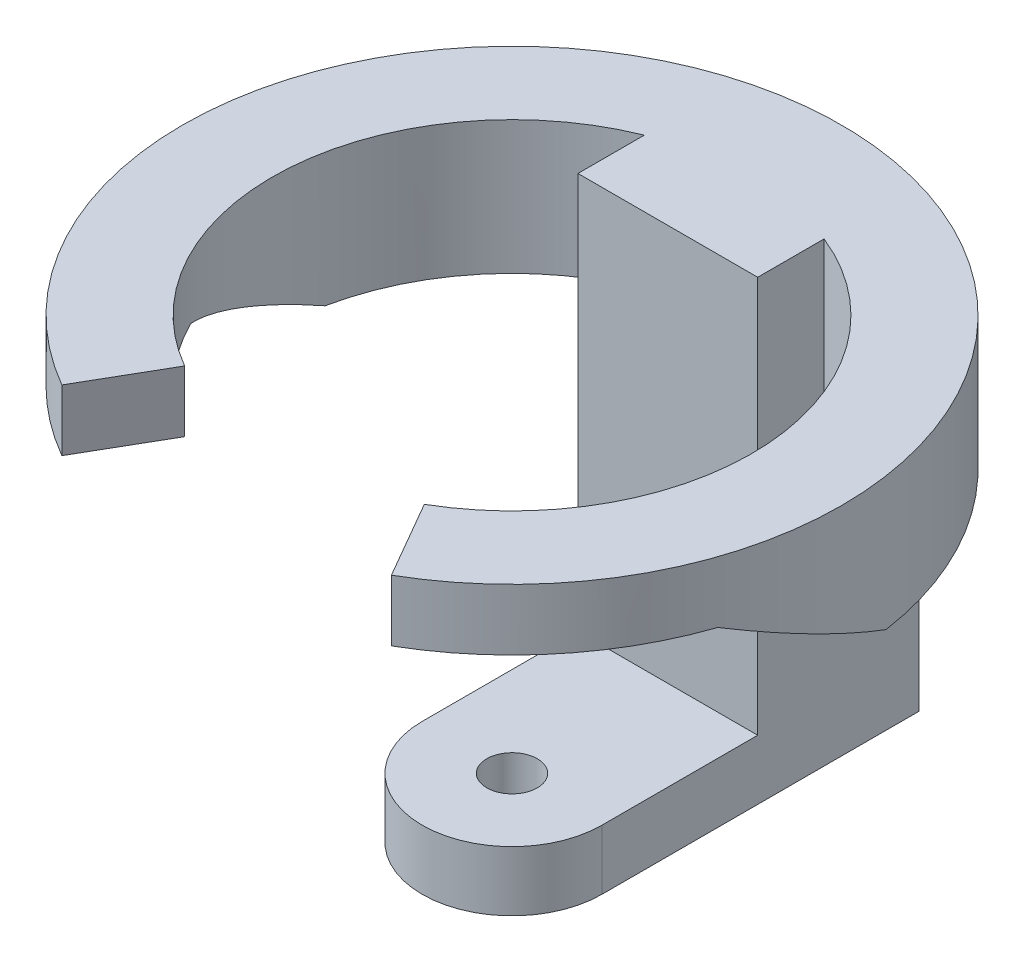
ISO-10303-21;
HEADER;
FILE_DESCRIPTION(('STEP AP214'),'2;1');
FILE_NAME('part.step','',(''),(''),'','','');
FILE_SCHEMA(('AUTOMOTIVE_DESIGN { 1 0 10303 214 1 1 1 1 }'));
ENDSEC;
DATA;
#1=APPLICATION_CONTEXT('core data for automotive mechanical design processes');
#2=APPLICATION_PROTOCOL_DEFINITION('international standard','automotive_design',2000,#1);
#3=PRODUCT_CONTEXT('',#1,'mechanical');
#4=PRODUCT('Part','Part','',(#3));
#5=PRODUCT_RELATED_PRODUCT_CATEGORY('part','',(#4));
#6=PRODUCT_DEFINITION_FORMATION('','',#4);
#7=PRODUCT_DEFINITION_CONTEXT('part definition',#1,'design');
#8=PRODUCT_DEFINITION('design','',#6,#7);
#9=PRODUCT_DEFINITION_SHAPE('','',#8);
#10=(LENGTH_UNIT() NAMED_UNIT(*) SI_UNIT(.MILLI.,.METRE.));
#11=(NAMED_UNIT(*) PLANE_ANGLE_UNIT() SI_UNIT($,.RADIAN.));
#12=(NAMED_UNIT(*) SI_UNIT($,.STERADIAN.) SOLID_ANGLE_UNIT());
#13=UNCERTAINTY_MEASURE_WITH_UNIT(LENGTH_MEASURE(1.E-05),#10,'distance_accuracy_value','');
#14=(GEOMETRIC_REPRESENTATION_CONTEXT(3) GLOBAL_UNCERTAINTY_ASSIGNED_CONTEXT((#13)) GLOBAL_UNIT_ASSIGNED_CONTEXT((#10,
#11,#12)) REPRESENTATION_CONTEXT('',''));
#15=CARTESIAN_POINT('',(0.,0.,0.));
#16=DIRECTION('',(0.,0.,1.));
#17=DIRECTION('',(1.,0.,0.));
#18=AXIS2_PLACEMENT_3D('',#15,#16,#17);
#19=CARTESIAN_POINT('',(15.,10.,0.));
#20=DIRECTION('',(-1.,0.,0.));
#21=DIRECTION('',(0.,0.,1.));
#22=AXIS2_PLACEMENT_3D('',#19,#20,#21);
#23=PLANE('',#22);
#24=DIRECTION('',(0.,1.,0.));
#25=VECTOR('',#24,1.);
#26=CARTESIAN_POINT('',(15.,80.01,-37.0809924354783));
#27=LINE('',#26,#25);
#28=CARTESIAN_POINT('',(14.9999999999676,76.2,-37.0809924354914));
#29=VERTEX_POINT('',#28);
#30=CARTESIAN_POINT('',(15.,53.975,-37.0809924354783));
#31=VERTEX_POINT('',#30);
#32=EDGE_CURVE('E200',#29,#31,#27,.F.);
#33=ORIENTED_EDGE('',*,*,#32,.F.);
#34=DIRECTION('',(0.,0.,-1.));
#35=VECTOR('',#34,1.);
#36=CARTESIAN_POINT('',(14.9999999999864,76.2,291541.5));
#37=LINE('',#36,#35);
#38=CARTESIAN_POINT('',(14.9999999999676,76.2,-26.0000000000105));
#39=VERTEX_POINT('',#38);
#40=EDGE_CURVE('E212',#39,#29,#37,.T.);
#41=ORIENTED_EDGE('',*,*,#40,.F.);
#42=DIRECTION('',(0.,-1.,0.));
#43=VECTOR('',#42,1.);
#44=CARTESIAN_POINT('',(14.9999999999676,76.2,-26.0000000000105));
#45=LINE('',#44,#43);
#46=CARTESIAN_POINT('',(15.,10.,-26.0000000000105));
#47=VERTEX_POINT('',#46);
#48=EDGE_CURVE('E215',#39,#47,#45,.T.);
#49=ORIENTED_EDGE('',*,*,#48,.T.);
#50=DIRECTION('',(0.,0.,-1.));
#51=VECTOR('',#50,1.);
#52=CARTESIAN_POINT('',(15.,10.,0.));
#53=LINE('',#52,#51);
#54=CARTESIAN_POINT('',(15.,10.,0.));
#55=VERTEX_POINT('',#54);
#56=EDGE_CURVE('E227',#55,#47,#53,.T.);
#57=ORIENTED_EDGE('',*,*,#56,.F.);
#58=DIRECTION('',(0.,-1.,0.));
#59=VECTOR('',#58,1.);
#60=CARTESIAN_POINT('',(15.,10.,0.));
#61=LINE('',#60,#59);
#62=CARTESIAN_POINT('',(15.,0.,0.));
#63=VERTEX_POINT('',#62);
#64=EDGE_CURVE('E248',#55,#63,#61,.T.);
#65=ORIENTED_EDGE('',*,*,#64,.T.);
#66=DIRECTION('',(0.,0.,-1.));
#67=VECTOR('',#66,1.);
#68=CARTESIAN_POINT('',(15.,0.,0.));
#69=LINE('',#68,#67);
#70=CARTESIAN_POINT('',(15.,0.,-52.9150262212918));
#71=VERTEX_POINT('',#70);
#72=EDGE_CURVE('E235',#63,#71,#69,.T.);
#73=ORIENTED_EDGE('',*,*,#72,.T.);
#74=DIRECTION('',(0.,-1.,0.));
#75=VECTOR('',#74,1.);
#76=CARTESIAN_POINT('',(15.,10.,-52.9150262212918));
#77=LINE('',#76,#75);
#78=CARTESIAN_POINT('',(14.9999999999859,53.975,-52.9150262212958));
#79=VERTEX_POINT('',#78);
#80=EDGE_CURVE('E246',#79,#71,#77,.T.);
#81=ORIENTED_EDGE('',*,*,#80,.F.);
#82=DIRECTION('',(0.,0.,-1.));
#83=VECTOR('',#82,1.);
#84=CARTESIAN_POINT('',(15.,53.975,0.));
#85=LINE('',#84,#83);
#86=EDGE_CURVE('E203',#31,#79,#85,.T.);
#87=ORIENTED_EDGE('',*,*,#86,.F.);
#88=EDGE_LOOP('',(#33,#41,#49,#57,#65,#73,#81,#87));
#89=FACE_BOUND('',#88,.T.);
#90=ADVANCED_FACE('F34',(#89),#23,.F.);
#91=CARTESIAN_POINT('',(-15.,10.,-52.9150262212918));
#92=DIRECTION('',(1.,0.,0.));
#93=DIRECTION('',(0.,0.,-1.));
#94=AXIS2_PLACEMENT_3D('',#91,#92,#93);
#95=PLANE('',#94);
#96=DIRECTION('',(0.,1.,0.));
#97=VECTOR('',#96,1.);
#98=CARTESIAN_POINT('',(-15.,80.01,-37.0809924354783));
#99=LINE('',#98,#97);
#100=CARTESIAN_POINT('',(-15.,53.975,-37.0809924354783));
#101=VERTEX_POINT('',#100);
#102=CARTESIAN_POINT('',(-14.9999999999864,76.2,-37.0809924354838));
#103=VERTEX_POINT('',#102);
#104=EDGE_CURVE('E197',#101,#103,#99,.T.);
#105=ORIENTED_EDGE('',*,*,#104,.F.);
#106=DIRECTION('',(0.,0.,1.));
#107=VECTOR('',#106,1.);
#108=CARTESIAN_POINT('',(-15.,53.975,-52.9150262212918));
#109=LINE('',#108,#107);
#110=CARTESIAN_POINT('',(-15.,53.975,-52.9150262212918));
#111=VERTEX_POINT('',#110);
#112=EDGE_CURVE('E251',#111,#101,#109,.T.);
#113=ORIENTED_EDGE('',*,*,#112,.F.);
#114=DIRECTION('',(0.,-1.,0.));
#115=VECTOR('',#114,1.);
#116=CARTESIAN_POINT('',(-15.,10.,-52.9150262212918));
#117=LINE('',#116,#115);
#118=CARTESIAN_POINT('',(-15.,0.,-52.9150262212918));
#119=VERTEX_POINT('',#118);
#120=EDGE_CURVE('E244',#111,#119,#117,.T.);
#121=ORIENTED_EDGE('',*,*,#120,.T.);
#122=DIRECTION('',(0.,0.,1.));
#123=VECTOR('',#122,1.);
#124=CARTESIAN_POINT('',(-15.,0.,-52.9150262212918));
#125=LINE('',#124,#123);
#126=CARTESIAN_POINT('',(-15.,0.,0.));
#127=VERTEX_POINT('',#126);
#128=EDGE_CURVE('E228',#119,#127,#125,.T.);
#129=ORIENTED_EDGE('',*,*,#128,.T.);
#130=DIRECTION('',(0.,-1.,0.));
#131=VECTOR('',#130,1.);
#132=CARTESIAN_POINT('',(-15.,10.,0.));
#133=LINE('',#132,#131);
#134=CARTESIAN_POINT('',(-15.,10.,0.));
#135=VERTEX_POINT('',#134);
#136=EDGE_CURVE('E232',#135,#127,#133,.T.);
#137=ORIENTED_EDGE('',*,*,#136,.F.);
#138=DIRECTION('',(0.,0.,1.));
#139=VECTOR('',#138,1.);
#140=CARTESIAN_POINT('',(-15.,10.,-52.9150262212918));
#141=LINE('',#140,#139);
#142=CARTESIAN_POINT('',(-15.,10.,-26.000000000021));
#143=VERTEX_POINT('',#142);
#144=EDGE_CURVE('E230',#143,#135,#141,.T.);
#145=ORIENTED_EDGE('',*,*,#144,.F.);
#146=DIRECTION('',(0.,-1.,0.));
#147=VECTOR('',#146,1.);
#148=CARTESIAN_POINT('',(-14.9999999999864,76.2,-26.000000000021));
#149=LINE('',#148,#147);
#150=CARTESIAN_POINT('',(-14.9999999999864,76.2,-26.000000000021));
#151=VERTEX_POINT('',#150);
#152=EDGE_CURVE('E218',#151,#143,#149,.T.);
#153=ORIENTED_EDGE('',*,*,#152,.F.);
#154=DIRECTION('',(0.,0.,1.));
#155=VECTOR('',#154,1.);
#156=CARTESIAN_POINT('',(-14.9999999999864,76.2,291541.5));
#157=LINE('',#156,#155);
#158=EDGE_CURVE('E208',#103,#151,#157,.T.);
#159=ORIENTED_EDGE('',*,*,#158,.F.);
#160=EDGE_LOOP('',(#105,#113,#121,#129,#137,#145,#153,#159));
#161=FACE_BOUND('',#160,.T.);
#162=ADVANCED_FACE('F300',(#161),#95,.F.);
#163=CARTESIAN_POINT('',(0.,10.,0.));
#164=DIRECTION('',(0.,1.,0.));
#165=DIRECTION('',(0.,0.,1.));
#166=AXIS2_PLACEMENT_3D('',#163,#164,#165);
#167=PLANE('',#166);
#168=CARTESIAN_POINT('',(0.,10.,0.));
#169=DIRECTION('',(0.,1.,0.));
#170=DIRECTION('',(0.,0.,1.));
#171=AXIS2_PLACEMENT_3D('',#168,#169,#170);
#172=CIRCLE('',#171,4.2164);
#173=CARTESIAN_POINT('',(0.,10.,4.2164));
#174=VERTEX_POINT('',#173);
#175=EDGE_CURVE('E284',#174,#174,#172,.T.);
#176=ORIENTED_EDGE('',*,*,#175,.F.);
#177=EDGE_LOOP('',(#176));
#178=FACE_BOUND('',#177,.T.);
#179=ORIENTED_EDGE('',*,*,#56,.T.);
#180=DIRECTION('',(-1.,0.,0.));
#181=VECTOR('',#180,1.);
#182=CARTESIAN_POINT('',(0.,10.,-26.000000000021));
#183=LINE('',#182,#181);
#184=EDGE_CURVE('E221',#47,#143,#183,.T.);
#185=ORIENTED_EDGE('',*,*,#184,.T.);
#186=ORIENTED_EDGE('',*,*,#144,.T.);
#187=CARTESIAN_POINT('',(0.,10.,0.));
#188=DIRECTION('',(0.,1.,0.));
#189=DIRECTION('',(0.,0.,1.));
#190=AXIS2_PLACEMENT_3D('',#187,#188,#189);
#191=CIRCLE('',#190,15.);
#192=EDGE_CURVE('E224',#135,#55,#191,.T.);
#193=ORIENTED_EDGE('',*,*,#192,.T.);
#194=EDGE_LOOP('',(#179,#185,#186,#193));
#195=FACE_BOUND('',#194,.T.);
#196=ADVANCED_FACE('F311',(#178,#195),#167,.T.);
#197=CARTESIAN_POINT('',(0.,10.,0.));
#198=DIRECTION('',(0.,-1.,0.));
#199=DIRECTION('',(0.,0.,-1.));
#200=AXIS2_PLACEMENT_3D('',#197,#198,#199);
#201=CYLINDRICAL_SURFACE('',#200,15.);
#202=CARTESIAN_POINT('',(0.,0.,0.));
#203=DIRECTION('',(0.,1.,0.));
#204=DIRECTION('',(0.,0.,1.));
#205=AXIS2_PLACEMENT_3D('',#202,#203,#204);
#206=CIRCLE('',#205,15.);
#207=EDGE_CURVE('E223',#127,#63,#206,.T.);
#208=ORIENTED_EDGE('',*,*,#207,.T.);
#209=ORIENTED_EDGE('',*,*,#64,.F.);
#210=ORIENTED_EDGE('',*,*,#192,.F.);
#211=ORIENTED_EDGE('',*,*,#136,.T.);
#212=EDGE_LOOP('',(#208,#209,#210,#211));
#213=FACE_BOUND('',#212,.T.);
#214=ADVANCED_FACE('F36',(#213),#201,.T.);
#215=CARTESIAN_POINT('',(0.,10.,0.));
#216=DIRECTION('',(0.,-1.,0.));
#217=DIRECTION('',(0.,0.,-1.));
#218=AXIS2_PLACEMENT_3D('',#215,#216,#217);
#219=CYLINDRICAL_SURFACE('',#218,55.);
#220=CARTESIAN_POINT('',(0.,53.975,0.));
#221=DIRECTION('',(0.,1.,0.));
#222=DIRECTION('',(0.,0.,1.));
#223=AXIS2_PLACEMENT_3D('',#220,#221,#222);
#224=CIRCLE('',#223,55.);
#225=CARTESIAN_POINT('',(-54.4150714416512,53.975,-8.));
#226=VERTEX_POINT('',#225);
#227=EDGE_CURVE('E191',#111,#226,#224,.T.);
#228=ORIENTED_EDGE('',*,*,#227,.T.);
#229=CARTESIAN_POINT('',(0.,57.7054612652399,0.));
#230=DIRECTION('',(0.,0.906307787036653,-0.422618261740694));
#231=DIRECTION('',(0.,-0.422618261740694,-0.906307787036653));
#232=AXIS2_PLACEMENT_3D('',#229,#230,#231);
#233=ELLIPSE('',#232,60.6857855429369,55.);
#234=CARTESIAN_POINT('',(-52.062484559551,65.975,17.7340830461151));
#235=VERTEX_POINT('',#234);
#236=EDGE_CURVE('E167',#226,#235,#233,.T.);
#237=ORIENTED_EDGE('',*,*,#236,.T.);
#238=CARTESIAN_POINT('',(0.,65.975,0.));
#239=DIRECTION('',(0.,1.,0.));
#240=DIRECTION('',(0.,0.,1.));
#241=AXIS2_PLACEMENT_3D('',#238,#239,#240);
#242=CIRCLE('',#241,55.);
#243=CARTESIAN_POINT('',(-27.4999999999997,65.975,47.6313972081443));
#244=VERTEX_POINT('',#243);
#245=EDGE_CURVE('E152',#235,#244,#242,.T.);
#246=ORIENTED_EDGE('',*,*,#245,.T.);
#247=DIRECTION('',(0.,1.,0.));
#248=VECTOR('',#247,1.);
#249=CARTESIAN_POINT('',(-27.4999999999997,76.2,47.6313972081443));
#250=LINE('',#249,#248);
#251=CARTESIAN_POINT('',(-27.4999999999997,76.2,47.6313972081443));
#252=VERTEX_POINT('',#251);
#253=EDGE_CURVE('E165',#244,#252,#250,.T.);
#254=ORIENTED_EDGE('',*,*,#253,.T.);
#255=CARTESIAN_POINT('',(0.,76.2,0.));
#256=DIRECTION('',(0.,1.,0.));
#257=DIRECTION('',(0.,0.,1.));
#258=AXIS2_PLACEMENT_3D('',#255,#256,#257);
#259=CIRCLE('',#258,55.);
#260=CARTESIAN_POINT('',(27.4999999999997,76.2,47.6313972081443));
#261=VERTEX_POINT('',#260);
#262=EDGE_CURVE('E206',#261,#252,#259,.T.);
#263=ORIENTED_EDGE('',*,*,#262,.F.);
#264=DIRECTION('',(0.,1.,0.));
#265=VECTOR('',#264,1.);
#266=CARTESIAN_POINT('',(27.4999999999997,76.2,47.6313972081443));
#267=LINE('',#266,#265);
#268=CARTESIAN_POINT('',(27.4999999999997,65.975,47.6313972081443));
#269=VERTEX_POINT('',#268);
#270=EDGE_CURVE('E183',#269,#261,#267,.T.);
#271=ORIENTED_EDGE('',*,*,#270,.F.);
#272=CARTESIAN_POINT('',(52.0624845595511,65.975,17.7340830461151));
#273=VERTEX_POINT('',#272);
#274=EDGE_CURVE('E57',#269,#273,#242,.T.);
#275=ORIENTED_EDGE('',*,*,#274,.T.);
#276=CARTESIAN_POINT('',(54.4150714416512,53.975,-8.));
#277=VERTEX_POINT('',#276);
#278=EDGE_CURVE('E289',#273,#277,#233,.T.);
#279=ORIENTED_EDGE('',*,*,#278,.T.);
#280=EDGE_CURVE('E192',#277,#79,#224,.T.);
#281=ORIENTED_EDGE('',*,*,#280,.T.);
#282=ORIENTED_EDGE('',*,*,#80,.T.);
#283=CARTESIAN_POINT('',(0.,0.,0.));
#284=DIRECTION('',(0.,1.,0.));
#285=DIRECTION('',(0.,0.,1.));
#286=AXIS2_PLACEMENT_3D('',#283,#284,#285);
#287=CIRCLE('',#286,55.);
#288=EDGE_CURVE('E238',#71,#119,#287,.T.);
#289=ORIENTED_EDGE('',*,*,#288,.T.);
#290=ORIENTED_EDGE('',*,*,#120,.F.);
#291=EDGE_LOOP('',(#228,#237,#246,#254,#263,#271,#275,#279,#281,#282,#289,#290));
#292=FACE_BOUND('',#291,.T.);
#293=ADVANCED_FACE('F163',(#292),#219,.T.);
#294=CARTESIAN_POINT('',(0.,0.,0.));
#295=DIRECTION('',(0.,1.,0.));
#296=DIRECTION('',(0.,0.,1.));
#297=AXIS2_PLACEMENT_3D('',#294,#295,#296);
#298=PLANE('',#297);
#299=CARTESIAN_POINT('',(0.,0.,0.));
#300=DIRECTION('',(0.,1.,0.));
#301=DIRECTION('',(0.,0.,1.));
#302=AXIS2_PLACEMENT_3D('',#299,#300,#301);
#303=CIRCLE('',#302,4.2164);
#304=CARTESIAN_POINT('',(0.,0.,4.2164));
#305=VERTEX_POINT('',#304);
#306=EDGE_CURVE('E280',#305,#305,#303,.T.);
#307=ORIENTED_EDGE('',*,*,#306,.T.);
#308=EDGE_LOOP('',(#307));
#309=FACE_BOUND('',#308,.T.);
#310=ORIENTED_EDGE('',*,*,#288,.F.);
#311=ORIENTED_EDGE('',*,*,#72,.F.);
#312=ORIENTED_EDGE('',*,*,#207,.F.);
#313=ORIENTED_EDGE('',*,*,#128,.F.);
#314=EDGE_LOOP('',(#310,#311,#312,#313));
#315=FACE_BOUND('',#314,.T.);
#316=ADVANCED_FACE('F317',(#309,#315),#298,.F.);
#317=CARTESIAN_POINT('',(-400000.,76.2,-26.0000000000673));
#318=DIRECTION('',(0.,0.,-1.));
#319=DIRECTION('',(-1.,0.,0.));
#320=AXIS2_PLACEMENT_3D('',#317,#318,#319);
#321=PLANE('',#320);
#322=ORIENTED_EDGE('',*,*,#184,.F.);
#323=ORIENTED_EDGE('',*,*,#48,.F.);
#324=DIRECTION('',(1.,0.,0.));
#325=VECTOR('',#324,1.);
#326=CARTESIAN_POINT('',(-400000.,76.2,-26.0000000000673));
#327=LINE('',#326,#325);
#328=EDGE_CURVE('E210',#151,#39,#327,.T.);
#329=ORIENTED_EDGE('',*,*,#328,.F.);
#330=ORIENTED_EDGE('',*,*,#152,.T.);
#331=EDGE_LOOP('',(#322,#323,#329,#330));
#332=FACE_BOUND('',#331,.T.);
#333=ADVANCED_FACE('F307',(#332),#321,.F.);
#334=CARTESIAN_POINT('',(0.,76.2,0.));
#335=DIRECTION('',(0.,1.,0.));
#336=DIRECTION('',(0.,0.,1.));
#337=AXIS2_PLACEMENT_3D('',#334,#335,#336);
#338=PLANE('',#337);
#339=ORIENTED_EDGE('',*,*,#262,.T.);
#340=DIRECTION('',(0.499999999999995,0.,-0.866025403784442));
#341=VECTOR('',#340,1.);
#342=CARTESIAN_POINT('',(-19.9999999999998,76.2,34.6410161513777));
#343=LINE('',#342,#341);
#344=CARTESIAN_POINT('',(-19.9999999999998,76.2,34.6410161513777));
#345=VERTEX_POINT('',#344);
#346=EDGE_CURVE('E173',#252,#345,#343,.T.);
#347=ORIENTED_EDGE('',*,*,#346,.T.);
#348=CARTESIAN_POINT('',(0.,76.2,0.));
#349=DIRECTION('',(0.,1.,0.));
#350=DIRECTION('',(0.,0.,1.));
#351=AXIS2_PLACEMENT_3D('',#348,#349,#350);
#352=CIRCLE('',#351,40.);
#353=EDGE_CURVE('E188',#103,#345,#352,.T.);
#354=ORIENTED_EDGE('',*,*,#353,.F.);
#355=ORIENTED_EDGE('',*,*,#158,.T.);
#356=ORIENTED_EDGE('',*,*,#328,.T.);
#357=ORIENTED_EDGE('',*,*,#40,.T.);
#358=CARTESIAN_POINT('',(19.9999999999998,76.2,34.6410161513777));
#359=VERTEX_POINT('',#358);
#360=EDGE_CURVE('E189',#359,#29,#352,.T.);
#361=ORIENTED_EDGE('',*,*,#360,.F.);
#362=DIRECTION('',(-0.499999999999995,0.,-0.866025403784442));
#363=VECTOR('',#362,1.);
#364=CARTESIAN_POINT('',(19.9999999999998,76.2,34.6410161513777));
#365=LINE('',#364,#363);
#366=EDGE_CURVE('E185',#261,#359,#365,.T.);
#367=ORIENTED_EDGE('',*,*,#366,.F.);
#368=EDGE_LOOP('',(#339,#347,#354,#355,#356,#357,#361,#367));
#369=FACE_BOUND('',#368,.T.);
#370=ADVANCED_FACE('F267',(#369),#338,.T.);
#371=CARTESIAN_POINT('',(0.,0.,0.));
#372=DIRECTION('',(-0.866025403784442,0.,-0.499999999999995));
#373=DIRECTION('',(-0.499999999999995,0.,0.866025403784442));
#374=AXIS2_PLACEMENT_3D('',#371,#372,#373);
#375=PLANE('',#374);
#376=ORIENTED_EDGE('',*,*,#253,.F.);
#377=DIRECTION('',(0.499999999999995,0.,-0.866025403784442));
#378=VECTOR('',#377,1.);
#379=CARTESIAN_POINT('',(0.,65.975,0.));
#380=LINE('',#379,#378);
#381=CARTESIAN_POINT('',(-19.9999999999998,65.975,34.6410161513777));
#382=VERTEX_POINT('',#381);
#383=EDGE_CURVE('E148',#244,#382,#380,.T.);
#384=ORIENTED_EDGE('',*,*,#383,.T.);
#385=DIRECTION('',(0.,-1.,0.));
#386=VECTOR('',#385,1.);
#387=CARTESIAN_POINT('',(-19.9999999999998,76.2,34.6410161513777));
#388=LINE('',#387,#386);
#389=EDGE_CURVE('E174',#345,#382,#388,.T.);
#390=ORIENTED_EDGE('',*,*,#389,.F.);
#391=ORIENTED_EDGE('',*,*,#346,.F.);
#392=EDGE_LOOP('',(#376,#384,#390,#391));
#393=FACE_BOUND('',#392,.T.);
#394=ADVANCED_FACE('F171',(#393),#375,.F.);
#395=CARTESIAN_POINT('',(19.9999999999998,53.975,34.6410161513777));
#396=DIRECTION('',(0.,1.,0.));
#397=DIRECTION('',(0.,0.,1.));
#398=AXIS2_PLACEMENT_3D('',#395,#396,#397);
#399=PLANE('',#398);
#400=CARTESIAN_POINT('',(0.,53.975,0.));
#401=DIRECTION('',(0.,1.,0.));
#402=DIRECTION('',(0.,0.,1.));
#403=AXIS2_PLACEMENT_3D('',#400,#401,#402);
#404=CIRCLE('',#403,40.);
#405=CARTESIAN_POINT('',(-39.1918358845308,53.975,-7.99999999999999));
#406=VERTEX_POINT('',#405);
#407=EDGE_CURVE('E194',#101,#406,#404,.T.);
#408=ORIENTED_EDGE('',*,*,#407,.T.);
#409=DIRECTION('',(1.,0.,0.));
#410=VECTOR('',#409,1.);
#411=CARTESIAN_POINT('',(-55.,53.975,-8.));
#412=LINE('',#411,#410);
#413=EDGE_CURVE('E49',#226,#406,#412,.T.);
#414=ORIENTED_EDGE('',*,*,#413,.F.);
#415=ORIENTED_EDGE('',*,*,#227,.F.);
#416=ORIENTED_EDGE('',*,*,#112,.T.);
#417=EDGE_LOOP('',(#408,#414,#415,#416));
#418=FACE_BOUND('',#417,.T.);
#419=ADVANCED_FACE('F320',(#418),#399,.F.);
#420=CARTESIAN_POINT('',(0.,80.01,0.));
#421=DIRECTION('',(0.,1.,0.));
#422=DIRECTION('',(0.,0.,1.));
#423=AXIS2_PLACEMENT_3D('',#420,#421,#422);
#424=CYLINDRICAL_SURFACE('',#423,40.);
#425=ORIENTED_EDGE('',*,*,#389,.T.);
#426=CARTESIAN_POINT('',(0.,65.975,0.));
#427=DIRECTION('',(0.,1.,0.));
#428=DIRECTION('',(0.,0.,1.));
#429=AXIS2_PLACEMENT_3D('',#426,#427,#428);
#430=CIRCLE('',#429,40.);
#431=CARTESIAN_POINT('',(-35.8539021378914,65.975,17.7340830461151));
#432=VERTEX_POINT('',#431);
#433=EDGE_CURVE('E155',#382,#432,#430,.F.);
#434=ORIENTED_EDGE('',*,*,#433,.T.);
#435=CARTESIAN_POINT('',(0.,57.7054612652399,0.));
#436=DIRECTION('',(0.,0.906307787036653,-0.422618261740694));
#437=DIRECTION('',(0.,0.422618261740694,0.906307787036653));
#438=AXIS2_PLACEMENT_3D('',#435,#436,#437);
#439=ELLIPSE('',#438,44.1351167584995,40.);
#440=EDGE_CURVE('E168',#432,#406,#439,.F.);
#441=ORIENTED_EDGE('',*,*,#440,.T.);
#442=ORIENTED_EDGE('',*,*,#407,.F.);
#443=ORIENTED_EDGE('',*,*,#104,.T.);
#444=ORIENTED_EDGE('',*,*,#353,.T.);
#445=EDGE_LOOP('',(#425,#434,#441,#442,#443,#444));
#446=FACE_BOUND('',#445,.T.);
#447=ADVANCED_FACE('F292',(#446),#424,.F.);
#448=ORIENTED_EDGE('',*,*,#280,.F.);
#449=CARTESIAN_POINT('',(39.1918358845308,53.975,-8.));
#450=VERTEX_POINT('',#449);
#451=EDGE_CURVE('E278',#450,#277,#412,.T.);
#452=ORIENTED_EDGE('',*,*,#451,.F.);
#453=EDGE_CURVE('E195',#450,#31,#404,.T.);
#454=ORIENTED_EDGE('',*,*,#453,.T.);
#455=ORIENTED_EDGE('',*,*,#86,.T.);
#456=EDGE_LOOP('',(#448,#452,#454,#455));
#457=FACE_BOUND('',#456,.T.);
#458=ADVANCED_FACE('F275',(#457),#399,.F.);
#459=CARTESIAN_POINT('',(0.,57.7054612652399,0.));
#460=DIRECTION('',(0.,0.906307787036653,-0.422618261740694));
#461=DIRECTION('',(0.,0.422618261740694,0.906307787036653));
#462=AXIS2_PLACEMENT_3D('',#459,#460,#461);
#463=ELLIPSE('',#462,44.1351167584995,40.);
#464=CARTESIAN_POINT('',(35.8539021378914,65.975,17.7340830461151));
#465=VERTEX_POINT('',#464);
#466=EDGE_CURVE('E11',#450,#465,#463,.F.);
#467=ORIENTED_EDGE('',*,*,#466,.T.);
#468=CARTESIAN_POINT('',(0.,65.975,0.));
#469=DIRECTION('',(0.,1.,0.));
#470=DIRECTION('',(0.,0.,1.));
#471=AXIS2_PLACEMENT_3D('',#468,#469,#470);
#472=CIRCLE('',#471,40.);
#473=CARTESIAN_POINT('',(19.9999999999998,65.975,34.6410161513777));
#474=VERTEX_POINT('',#473);
#475=EDGE_CURVE('E254',#465,#474,#472,.F.);
#476=ORIENTED_EDGE('',*,*,#475,.T.);
#477=DIRECTION('',(0.,-1.,0.));
#478=VECTOR('',#477,1.);
#479=CARTESIAN_POINT('',(19.9999999999998,76.2,34.6410161513777));
#480=LINE('',#479,#478);
#481=EDGE_CURVE('E176',#359,#474,#480,.T.);
#482=ORIENTED_EDGE('',*,*,#481,.F.);
#483=ORIENTED_EDGE('',*,*,#360,.T.);
#484=ORIENTED_EDGE('',*,*,#32,.T.);
#485=ORIENTED_EDGE('',*,*,#453,.F.);
#486=EDGE_LOOP('',(#467,#476,#482,#483,#484,#485));
#487=FACE_BOUND('',#486,.T.);
#488=ADVANCED_FACE('F260',(#487),#424,.F.);
#489=CARTESIAN_POINT('',(0.,0.,0.));
#490=DIRECTION('',(-0.866025403784442,0.,0.499999999999995));
#491=DIRECTION('',(0.499999999999995,0.,0.866025403784442));
#492=AXIS2_PLACEMENT_3D('',#489,#490,#491);
#493=PLANE('',#492);
#494=DIRECTION('',(-0.499999999999995,0.,-0.866025403784442));
#495=VECTOR('',#494,1.);
#496=CARTESIAN_POINT('',(0.,65.975,0.));
#497=LINE('',#496,#495);
#498=EDGE_CURVE('E42',#269,#474,#497,.T.);
#499=ORIENTED_EDGE('',*,*,#498,.F.);
#500=ORIENTED_EDGE('',*,*,#270,.T.);
#501=ORIENTED_EDGE('',*,*,#366,.T.);
#502=ORIENTED_EDGE('',*,*,#481,.T.);
#503=EDGE_LOOP('',(#499,#500,#501,#502));
#504=FACE_BOUND('',#503,.T.);
#505=ADVANCED_FACE('F264',(#504),#493,.T.);
#506=CARTESIAN_POINT('',(-55.,65.975,17.7340830461151));
#507=DIRECTION('',(0.,1.,0.));
#508=DIRECTION('',(0.,0.,1.));
#509=AXIS2_PLACEMENT_3D('',#506,#507,#508);
#510=PLANE('',#509);
#511=ORIENTED_EDGE('',*,*,#498,.T.);
#512=ORIENTED_EDGE('',*,*,#475,.F.);
#513=DIRECTION('',(1.,0.,0.));
#514=VECTOR('',#513,1.);
#515=CARTESIAN_POINT('',(-55.,65.975,17.7340830461151));
#516=LINE('',#515,#514);
#517=EDGE_CURVE('E282',#465,#273,#516,.T.);
#518=ORIENTED_EDGE('',*,*,#517,.T.);
#519=ORIENTED_EDGE('',*,*,#274,.F.);
#520=EDGE_LOOP('',(#511,#512,#518,#519));
#521=FACE_BOUND('',#520,.T.);
#522=ADVANCED_FACE('F253',(#521),#510,.F.);
#523=CARTESIAN_POINT('',(-55.,53.975,-8.));
#524=DIRECTION('',(0.,0.906307787036653,-0.422618261740694));
#525=DIRECTION('',(0.,0.422618261740694,0.906307787036653));
#526=AXIS2_PLACEMENT_3D('',#523,#524,#525);
#527=PLANE('',#526);
#528=ORIENTED_EDGE('',*,*,#517,.F.);
#529=ORIENTED_EDGE('',*,*,#466,.F.);
#530=ORIENTED_EDGE('',*,*,#451,.T.);
#531=ORIENTED_EDGE('',*,*,#278,.F.);
#532=EDGE_LOOP('',(#528,#529,#530,#531));
#533=FACE_BOUND('',#532,.T.);
#534=ADVANCED_FACE('F290',(#533),#527,.F.);
#535=ORIENTED_EDGE('',*,*,#413,.T.);
#536=ORIENTED_EDGE('',*,*,#440,.F.);
#537=EDGE_CURVE('E262',#235,#432,#516,.T.);
#538=ORIENTED_EDGE('',*,*,#537,.F.);
#539=ORIENTED_EDGE('',*,*,#236,.F.);
#540=EDGE_LOOP('',(#535,#536,#538,#539));
#541=FACE_BOUND('',#540,.T.);
#542=ADVANCED_FACE('F407',(#541),#527,.F.);
#543=ORIENTED_EDGE('',*,*,#537,.T.);
#544=ORIENTED_EDGE('',*,*,#433,.F.);
#545=ORIENTED_EDGE('',*,*,#383,.F.);
#546=ORIENTED_EDGE('',*,*,#245,.F.);
#547=EDGE_LOOP('',(#543,#544,#545,#546));
#548=FACE_BOUND('',#547,.T.);
#549=ADVANCED_FACE('F151',(#548),#510,.F.);
#550=CARTESIAN_POINT('',(0.,10.,0.));
#551=DIRECTION('',(0.,1.,0.));
#552=DIRECTION('',(0.,0.,1.));
#553=AXIS2_PLACEMENT_3D('',#550,#551,#552);
#554=CYLINDRICAL_SURFACE('',#553,4.2164);
#555=ORIENTED_EDGE('',*,*,#306,.F.);
#556=EDGE_LOOP('',(#555));
#557=FACE_BOUND('',#556,.T.);
#558=ORIENTED_EDGE('',*,*,#175,.T.);
#559=EDGE_LOOP('',(#558));
#560=FACE_BOUND('',#559,.T.);
#561=ADVANCED_FACE('F423',(#557,#560),#554,.F.);
#562=CLOSED_SHELL('',(#90,#162,#196,#214,#293,#316,#333,#370,#394,#419,#447,#458,#488,#505,#522,
#534,#542,#549,#561));
#563=MANIFOLD_SOLID_BREP('B2',#562);
#564=ADVANCED_BREP_SHAPE_REPRESENTATION('',(#18,#563),#14);
#565=SHAPE_DEFINITION_REPRESENTATION(#9,#564);
ENDSEC;
END-ISO-10303-21;
